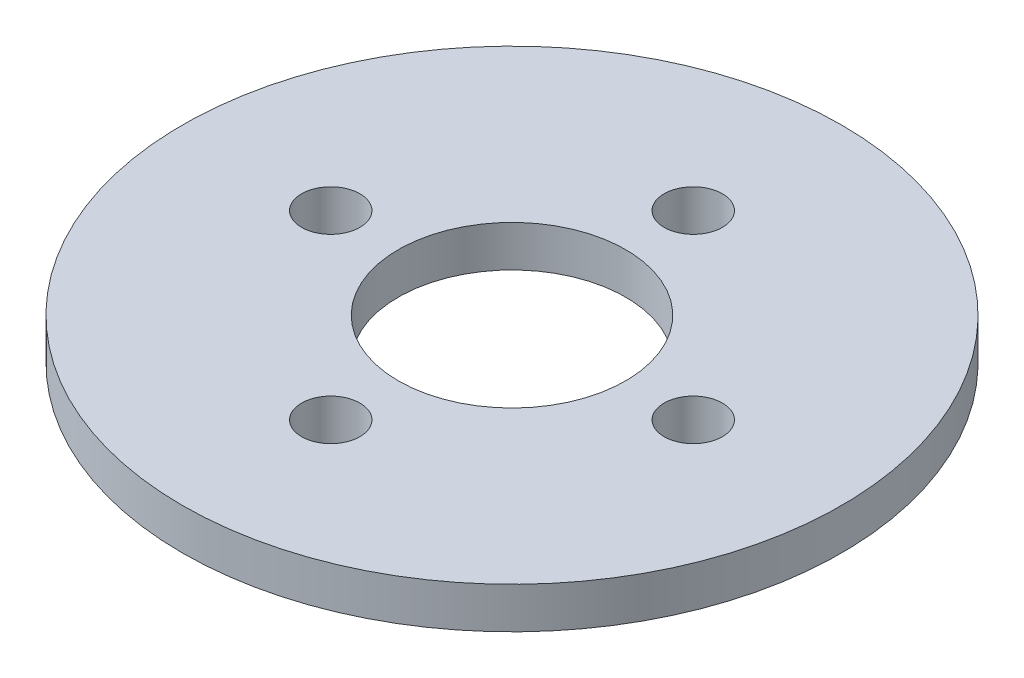
ISO-10303-21;
HEADER;
FILE_DESCRIPTION(('STEP AP214'),'2;1');
FILE_NAME('part.step','',(''),(''),'','','');
FILE_SCHEMA(('AUTOMOTIVE_DESIGN { 1 0 10303 214 1 1 1 1 }'));
ENDSEC;
DATA;
#1=APPLICATION_CONTEXT('core data for automotive mechanical design processes');
#2=APPLICATION_PROTOCOL_DEFINITION('international standard','automotive_design',2000,#1);
#3=PRODUCT_CONTEXT('',#1,'mechanical');
#4=PRODUCT('Part','Part','',(#3));
#5=PRODUCT_RELATED_PRODUCT_CATEGORY('part','',(#4));
#6=PRODUCT_DEFINITION_FORMATION('','',#4);
#7=PRODUCT_DEFINITION_CONTEXT('part definition',#1,'design');
#8=PRODUCT_DEFINITION('design','',#6,#7);
#9=PRODUCT_DEFINITION_SHAPE('','',#8);
#10=(LENGTH_UNIT() NAMED_UNIT(*) SI_UNIT(.MILLI.,.METRE.));
#11=(NAMED_UNIT(*) PLANE_ANGLE_UNIT() SI_UNIT($,.RADIAN.));
#12=(NAMED_UNIT(*) SI_UNIT($,.STERADIAN.) SOLID_ANGLE_UNIT());
#13=UNCERTAINTY_MEASURE_WITH_UNIT(LENGTH_MEASURE(1.E-05),#10,'distance_accuracy_value','');
#14=(GEOMETRIC_REPRESENTATION_CONTEXT(3) GLOBAL_UNCERTAINTY_ASSIGNED_CONTEXT((#13)) GLOBAL_UNIT_ASSIGNED_CONTEXT((#10,
#11,#12)) REPRESENTATION_CONTEXT('',''));
#15=CARTESIAN_POINT('',(0.,0.,0.));
#16=DIRECTION('',(0.,0.,1.));
#17=DIRECTION('',(1.,0.,0.));
#18=AXIS2_PLACEMENT_3D('',#15,#16,#17);
#19=CARTESIAN_POINT('',(0.,3.175,0.));
#20=DIRECTION('',(0.,1.,0.));
#21=DIRECTION('',(0.,0.,1.));
#22=AXIS2_PLACEMENT_3D('',#19,#20,#21);
#23=PLANE('',#22);
#24=CARTESIAN_POINT('',(0.,3.175,-13.97));
#25=DIRECTION('',(0.,1.,0.));
#26=DIRECTION('',(0.,0.,1.));
#27=AXIS2_PLACEMENT_3D('',#24,#25,#26);
#28=CIRCLE('',#27,2.24789999999999);
#29=CARTESIAN_POINT('',(0.,3.175,-11.7221));
#30=VERTEX_POINT('',#29);
#31=EDGE_CURVE('E88',#30,#30,#28,.T.);
#32=ORIENTED_EDGE('',*,*,#31,.F.);
#33=EDGE_LOOP('',(#32));
#34=FACE_BOUND('',#33,.T.);
#35=CARTESIAN_POINT('',(-13.97,3.175,0.));
#36=DIRECTION('',(0.,1.,0.));
#37=DIRECTION('',(0.,0.,1.));
#38=AXIS2_PLACEMENT_3D('',#35,#36,#37);
#39=CIRCLE('',#38,2.24789999999999);
#40=CARTESIAN_POINT('',(-13.97,3.175,2.24789999999999));
#41=VERTEX_POINT('',#40);
#42=EDGE_CURVE('E80',#41,#41,#39,.T.);
#43=ORIENTED_EDGE('',*,*,#42,.F.);
#44=EDGE_LOOP('',(#43));
#45=FACE_BOUND('',#44,.T.);
#46=CARTESIAN_POINT('',(0.,3.175,13.97));
#47=DIRECTION('',(0.,1.,0.));
#48=DIRECTION('',(0.,0.,1.));
#49=AXIS2_PLACEMENT_3D('',#46,#47,#48);
#50=CIRCLE('',#49,2.24789999999999);
#51=CARTESIAN_POINT('',(0.,3.175,16.2179));
#52=VERTEX_POINT('',#51);
#53=EDGE_CURVE('E72',#52,#52,#50,.T.);
#54=ORIENTED_EDGE('',*,*,#53,.F.);
#55=EDGE_LOOP('',(#54));
#56=FACE_BOUND('',#55,.T.);
#57=CARTESIAN_POINT('',(13.97,3.175,0.));
#58=DIRECTION('',(0.,1.,0.));
#59=DIRECTION('',(0.,0.,1.));
#60=AXIS2_PLACEMENT_3D('',#57,#58,#59);
#61=CIRCLE('',#60,2.24789999999998);
#62=CARTESIAN_POINT('',(13.97,3.175,2.24789999999998));
#63=VERTEX_POINT('',#62);
#64=EDGE_CURVE('E64',#63,#63,#61,.T.);
#65=ORIENTED_EDGE('',*,*,#64,.F.);
#66=EDGE_LOOP('',(#65));
#67=FACE_BOUND('',#66,.T.);
#68=CARTESIAN_POINT('',(0.,3.175,0.));
#69=DIRECTION('',(0.,1.,0.));
#70=DIRECTION('',(0.,0.,1.));
#71=AXIS2_PLACEMENT_3D('',#68,#69,#70);
#72=CIRCLE('',#71,25.4);
#73=CARTESIAN_POINT('',(0.,3.175,25.4));
#74=VERTEX_POINT('',#73);
#75=EDGE_CURVE('E10',#74,#74,#72,.T.);
#76=ORIENTED_EDGE('',*,*,#75,.T.);
#77=EDGE_LOOP('',(#76));
#78=FACE_BOUND('',#77,.T.);
#79=CARTESIAN_POINT('',(0.,3.175,0.));
#80=DIRECTION('',(0.,1.,0.));
#81=DIRECTION('',(0.,0.,1.));
#82=AXIS2_PLACEMENT_3D('',#79,#80,#81);
#83=CIRCLE('',#82,8.763);
#84=CARTESIAN_POINT('',(0.,3.175,8.763));
#85=VERTEX_POINT('',#84);
#86=EDGE_CURVE('E51',#85,#85,#83,.T.);
#87=ORIENTED_EDGE('',*,*,#86,.F.);
#88=EDGE_LOOP('',(#87));
#89=FACE_BOUND('',#88,.T.);
#90=ADVANCED_FACE('F37',(#34,#45,#56,#67,#78,#89),#23,.T.);
#91=CARTESIAN_POINT('',(0.,0.,0.));
#92=DIRECTION('',(0.,1.,0.));
#93=DIRECTION('',(0.,0.,1.));
#94=AXIS2_PLACEMENT_3D('',#91,#92,#93);
#95=PLANE('',#94);
#96=CARTESIAN_POINT('',(0.,0.,-13.97));
#97=DIRECTION('',(0.,1.,0.));
#98=DIRECTION('',(0.,0.,1.));
#99=AXIS2_PLACEMENT_3D('',#96,#97,#98);
#100=CIRCLE('',#99,2.2479);
#101=CARTESIAN_POINT('',(0.,0.,-11.7221));
#102=VERTEX_POINT('',#101);
#103=EDGE_CURVE('E84',#102,#102,#100,.T.);
#104=ORIENTED_EDGE('',*,*,#103,.T.);
#105=EDGE_LOOP('',(#104));
#106=FACE_BOUND('',#105,.T.);
#107=CARTESIAN_POINT('',(-13.97,0.,0.));
#108=DIRECTION('',(0.,1.,0.));
#109=DIRECTION('',(0.,0.,1.));
#110=AXIS2_PLACEMENT_3D('',#107,#108,#109);
#111=CIRCLE('',#110,2.2479);
#112=CARTESIAN_POINT('',(-13.97,0.,2.2479));
#113=VERTEX_POINT('',#112);
#114=EDGE_CURVE('E76',#113,#113,#111,.T.);
#115=ORIENTED_EDGE('',*,*,#114,.T.);
#116=EDGE_LOOP('',(#115));
#117=FACE_BOUND('',#116,.T.);
#118=CARTESIAN_POINT('',(0.,0.,13.97));
#119=DIRECTION('',(0.,1.,0.));
#120=DIRECTION('',(0.,0.,1.));
#121=AXIS2_PLACEMENT_3D('',#118,#119,#120);
#122=CIRCLE('',#121,2.2479);
#123=CARTESIAN_POINT('',(0.,0.,16.2179));
#124=VERTEX_POINT('',#123);
#125=EDGE_CURVE('E68',#124,#124,#122,.T.);
#126=ORIENTED_EDGE('',*,*,#125,.T.);
#127=EDGE_LOOP('',(#126));
#128=FACE_BOUND('',#127,.T.);
#129=CARTESIAN_POINT('',(13.97,0.,0.));
#130=DIRECTION('',(0.,1.,0.));
#131=DIRECTION('',(0.,0.,1.));
#132=AXIS2_PLACEMENT_3D('',#129,#130,#131);
#133=CIRCLE('',#132,2.2479);
#134=CARTESIAN_POINT('',(13.97,0.,2.2479));
#135=VERTEX_POINT('',#134);
#136=EDGE_CURVE('E57',#135,#135,#133,.T.);
#137=ORIENTED_EDGE('',*,*,#136,.T.);
#138=EDGE_LOOP('',(#137));
#139=FACE_BOUND('',#138,.T.);
#140=CARTESIAN_POINT('',(0.,0.,0.));
#141=DIRECTION('',(0.,1.,0.));
#142=DIRECTION('',(0.,0.,1.));
#143=AXIS2_PLACEMENT_3D('',#140,#141,#142);
#144=CIRCLE('',#143,25.4);
#145=CARTESIAN_POINT('',(0.,0.,25.4));
#146=VERTEX_POINT('',#145);
#147=EDGE_CURVE('E41',#146,#146,#144,.T.);
#148=ORIENTED_EDGE('',*,*,#147,.F.);
#149=EDGE_LOOP('',(#148));
#150=FACE_BOUND('',#149,.T.);
#151=CARTESIAN_POINT('',(0.,0.,0.));
#152=DIRECTION('',(0.,1.,0.));
#153=DIRECTION('',(0.,0.,1.));
#154=AXIS2_PLACEMENT_3D('',#151,#152,#153);
#155=CIRCLE('',#154,8.763);
#156=CARTESIAN_POINT('',(0.,0.,8.763));
#157=VERTEX_POINT('',#156);
#158=EDGE_CURVE('E53',#157,#157,#155,.T.);
#159=ORIENTED_EDGE('',*,*,#158,.T.);
#160=EDGE_LOOP('',(#159));
#161=FACE_BOUND('',#160,.T.);
#162=ADVANCED_FACE('F98',(#106,#117,#128,#139,#150,#161),#95,.F.);
#163=CARTESIAN_POINT('',(0.,3.175,0.));
#164=DIRECTION('',(0.,-1.,0.));
#165=DIRECTION('',(0.,0.,-1.));
#166=AXIS2_PLACEMENT_3D('',#163,#164,#165);
#167=CYLINDRICAL_SURFACE('',#166,25.4);
#168=ORIENTED_EDGE('',*,*,#75,.F.);
#169=EDGE_LOOP('',(#168));
#170=FACE_BOUND('',#169,.T.);
#171=ORIENTED_EDGE('',*,*,#147,.T.);
#172=EDGE_LOOP('',(#171));
#173=FACE_BOUND('',#172,.T.);
#174=ADVANCED_FACE('F39',(#170,#173),#167,.T.);
#175=CARTESIAN_POINT('',(0.,3.175,0.));
#176=DIRECTION('',(0.,-1.,0.));
#177=DIRECTION('',(0.,0.,-1.));
#178=AXIS2_PLACEMENT_3D('',#175,#176,#177);
#179=CYLINDRICAL_SURFACE('',#178,8.763);
#180=ORIENTED_EDGE('',*,*,#86,.T.);
#181=EDGE_LOOP('',(#180));
#182=FACE_BOUND('',#181,.T.);
#183=ORIENTED_EDGE('',*,*,#158,.F.);
#184=EDGE_LOOP('',(#183));
#185=FACE_BOUND('',#184,.T.);
#186=ADVANCED_FACE('F108',(#182,#185),#179,.F.);
#187=CARTESIAN_POINT('',(13.97,3.175,0.));
#188=DIRECTION('',(0.,1.,0.));
#189=DIRECTION('',(0.,0.,1.));
#190=AXIS2_PLACEMENT_3D('',#187,#188,#189);
#191=CYLINDRICAL_SURFACE('',#190,2.24789999999999);
#192=ORIENTED_EDGE('',*,*,#136,.F.);
#193=EDGE_LOOP('',(#192));
#194=FACE_BOUND('',#193,.T.);
#195=ORIENTED_EDGE('',*,*,#64,.T.);
#196=EDGE_LOOP('',(#195));
#197=FACE_BOUND('',#196,.T.);
#198=ADVANCED_FACE('F111',(#194,#197),#191,.F.);
#199=CARTESIAN_POINT('',(0.,3.175,13.97));
#200=DIRECTION('',(0.,1.,0.));
#201=DIRECTION('',(0.,0.,1.));
#202=AXIS2_PLACEMENT_3D('',#199,#200,#201);
#203=CYLINDRICAL_SURFACE('',#202,2.24789999999999);
#204=ORIENTED_EDGE('',*,*,#125,.F.);
#205=EDGE_LOOP('',(#204));
#206=FACE_BOUND('',#205,.T.);
#207=ORIENTED_EDGE('',*,*,#53,.T.);
#208=EDGE_LOOP('',(#207));
#209=FACE_BOUND('',#208,.T.);
#210=ADVANCED_FACE('F125',(#206,#209),#203,.F.);
#211=CARTESIAN_POINT('',(-13.97,3.175,0.));
#212=DIRECTION('',(0.,1.,0.));
#213=DIRECTION('',(0.,0.,1.));
#214=AXIS2_PLACEMENT_3D('',#211,#212,#213);
#215=CYLINDRICAL_SURFACE('',#214,2.24789999999999);
#216=ORIENTED_EDGE('',*,*,#114,.F.);
#217=EDGE_LOOP('',(#216));
#218=FACE_BOUND('',#217,.T.);
#219=ORIENTED_EDGE('',*,*,#42,.T.);
#220=EDGE_LOOP('',(#219));
#221=FACE_BOUND('',#220,.T.);
#222=ADVANCED_FACE('F129',(#218,#221),#215,.F.);
#223=CARTESIAN_POINT('',(0.,3.175,-13.97));
#224=DIRECTION('',(0.,1.,0.));
#225=DIRECTION('',(0.,0.,1.));
#226=AXIS2_PLACEMENT_3D('',#223,#224,#225);
#227=CYLINDRICAL_SURFACE('',#226,2.24789999999999);
#228=ORIENTED_EDGE('',*,*,#103,.F.);
#229=EDGE_LOOP('',(#228));
#230=FACE_BOUND('',#229,.T.);
#231=ORIENTED_EDGE('',*,*,#31,.T.);
#232=EDGE_LOOP('',(#231));
#233=FACE_BOUND('',#232,.T.);
#234=ADVANCED_FACE('F94',(#230,#233),#227,.F.);
#235=CLOSED_SHELL('',(#90,#162,#174,#186,#198,#210,#222,#234));
#236=MANIFOLD_SOLID_BREP('B2',#235);
#237=ADVANCED_BREP_SHAPE_REPRESENTATION('',(#18,#236),#14);
#238=SHAPE_DEFINITION_REPRESENTATION(#9,#237);
ENDSEC;
END-ISO-10303-21;
